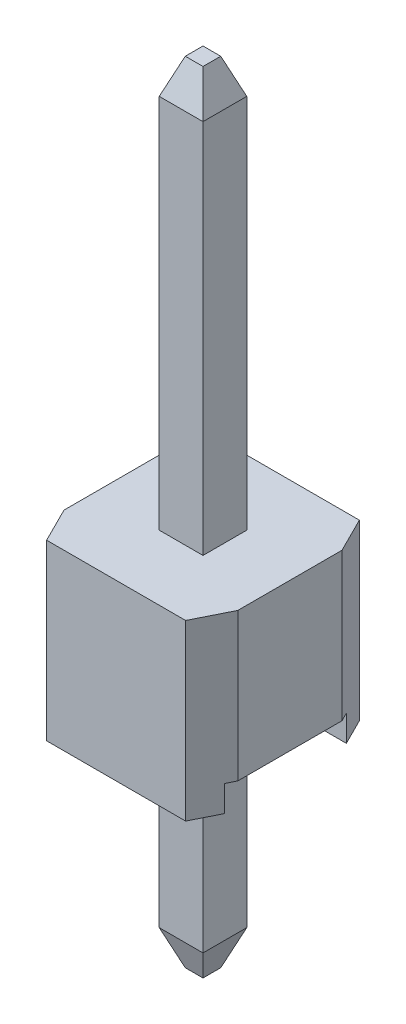
ISO-10303-21;
HEADER;
FILE_DESCRIPTION(('STEP AP214'),'2;1');
FILE_NAME('part.step','',(''),(''),'','','');
FILE_SCHEMA(('AUTOMOTIVE_DESIGN { 1 0 10303 214 1 1 1 1 }'));
ENDSEC;
DATA;
#1=APPLICATION_CONTEXT('core data for automotive mechanical design processes');
#2=APPLICATION_PROTOCOL_DEFINITION('international standard','automotive_design',2000,#1);
#3=PRODUCT_CONTEXT('',#1,'mechanical');
#4=PRODUCT('Part','Part','',(#3));
#5=PRODUCT_RELATED_PRODUCT_CATEGORY('part','',(#4));
#6=PRODUCT_DEFINITION_FORMATION('','',#4);
#7=PRODUCT_DEFINITION_CONTEXT('part definition',#1,'design');
#8=PRODUCT_DEFINITION('design','',#6,#7);
#9=PRODUCT_DEFINITION_SHAPE('','',#8);
#10=(LENGTH_UNIT() NAMED_UNIT(*) SI_UNIT(.MILLI.,.METRE.));
#11=(NAMED_UNIT(*) PLANE_ANGLE_UNIT() SI_UNIT($,.RADIAN.));
#12=(NAMED_UNIT(*) SI_UNIT($,.STERADIAN.) SOLID_ANGLE_UNIT());
#13=UNCERTAINTY_MEASURE_WITH_UNIT(LENGTH_MEASURE(1.E-05),#10,'distance_accuracy_value','');
#14=(GEOMETRIC_REPRESENTATION_CONTEXT(3) GLOBAL_UNCERTAINTY_ASSIGNED_CONTEXT((#13)) GLOBAL_UNIT_ASSIGNED_CONTEXT((#10,
#11,#12)) REPRESENTATION_CONTEXT('',''));
#15=CARTESIAN_POINT('',(0.,0.,0.));
#16=DIRECTION('',(0.,0.,1.));
#17=DIRECTION('',(1.,0.,0.));
#18=AXIS2_PLACEMENT_3D('',#15,#16,#17);
#19=CARTESIAN_POINT('',(0.,2.54,0.));
#20=DIRECTION('',(0.,0.,-1.));
#21=DIRECTION('',(-1.,0.,0.));
#22=AXIS2_PLACEMENT_3D('',#19,#20,#21);
#23=PLANE('',#22);
#24=DIRECTION('',(0.,1.,0.));
#25=VECTOR('',#24,1.);
#26=CARTESIAN_POINT('',(2.286,0.,0.));
#27=LINE('',#26,#25);
#28=CARTESIAN_POINT('',(2.286,0.,0.));
#29=VERTEX_POINT('',#28);
#30=CARTESIAN_POINT('',(2.286,2.54,0.));
#31=VERTEX_POINT('',#30);
#32=EDGE_CURVE('E388',#29,#31,#27,.T.);
#33=ORIENTED_EDGE('',*,*,#32,.T.);
#34=DIRECTION('',(1.,0.,0.));
#35=VECTOR('',#34,1.);
#36=CARTESIAN_POINT('',(0.,2.54,0.));
#37=LINE('',#36,#35);
#38=CARTESIAN_POINT('',(0.254,2.54,0.));
#39=VERTEX_POINT('',#38);
#40=EDGE_CURVE('E456',#39,#31,#37,.T.);
#41=ORIENTED_EDGE('',*,*,#40,.F.);
#42=DIRECTION('',(0.,1.,0.));
#43=VECTOR('',#42,1.);
#44=CARTESIAN_POINT('',(0.254,0.,0.));
#45=LINE('',#44,#43);
#46=CARTESIAN_POINT('',(0.254,0.,0.));
#47=VERTEX_POINT('',#46);
#48=EDGE_CURVE('E399',#47,#39,#45,.T.);
#49=ORIENTED_EDGE('',*,*,#48,.F.);
#50=DIRECTION('',(1.,0.,0.));
#51=VECTOR('',#50,1.);
#52=CARTESIAN_POINT('',(0.,0.,0.));
#53=LINE('',#52,#51);
#54=EDGE_CURVE('E447',#47,#29,#53,.T.);
#55=ORIENTED_EDGE('',*,*,#54,.T.);
#56=EDGE_LOOP('',(#33,#41,#49,#55));
#57=FACE_BOUND('',#56,.T.);
#58=ADVANCED_FACE('F35',(#57),#23,.F.);
#59=CARTESIAN_POINT('',(0.,2.54,0.));
#60=DIRECTION('',(0.,-1.,0.));
#61=DIRECTION('',(0.,0.,-1.));
#62=AXIS2_PLACEMENT_3D('',#59,#60,#61);
#63=PLANE('',#62);
#64=DIRECTION('',(0.,0.,1.));
#65=VECTOR('',#64,1.);
#66=CARTESIAN_POINT('',(1.59,2.54,0.));
#67=LINE('',#66,#65);
#68=CARTESIAN_POINT('',(1.59,2.54,-1.59));
#69=VERTEX_POINT('',#68);
#70=CARTESIAN_POINT('',(1.59,2.54,-0.95));
#71=VERTEX_POINT('',#70);
#72=EDGE_CURVE('E376',#69,#71,#67,.T.);
#73=ORIENTED_EDGE('',*,*,#72,.T.);
#74=DIRECTION('',(-1.,0.,0.));
#75=VECTOR('',#74,1.);
#76=CARTESIAN_POINT('',(0.,2.54,-0.95));
#77=LINE('',#76,#75);
#78=CARTESIAN_POINT('',(0.95,2.54,-0.95));
#79=VERTEX_POINT('',#78);
#80=EDGE_CURVE('E386',#71,#79,#77,.T.);
#81=ORIENTED_EDGE('',*,*,#80,.T.);
#82=DIRECTION('',(0.,0.,-1.));
#83=VECTOR('',#82,1.);
#84=CARTESIAN_POINT('',(0.95,2.54,0.));
#85=LINE('',#84,#83);
#86=CARTESIAN_POINT('',(0.95,2.54,-1.59));
#87=VERTEX_POINT('',#86);
#88=EDGE_CURVE('E360',#79,#87,#85,.T.);
#89=ORIENTED_EDGE('',*,*,#88,.T.);
#90=DIRECTION('',(1.,0.,0.));
#91=VECTOR('',#90,1.);
#92=CARTESIAN_POINT('',(0.,2.54,-1.59));
#93=LINE('',#92,#91);
#94=EDGE_CURVE('E383',#87,#69,#93,.T.);
#95=ORIENTED_EDGE('',*,*,#94,.T.);
#96=EDGE_LOOP('',(#73,#81,#89,#95));
#97=FACE_BOUND('',#96,.T.);
#98=DIRECTION('',(0.447213595499958,0.,-0.894427190999916));
#99=VECTOR('',#98,1.);
#100=CARTESIAN_POINT('',(2.286,2.54,0.));
#101=LINE('',#100,#99);
#102=CARTESIAN_POINT('',(2.54,2.54,-0.508));
#103=VERTEX_POINT('',#102);
#104=EDGE_CURVE('E391',#31,#103,#101,.T.);
#105=ORIENTED_EDGE('',*,*,#104,.T.);
#106=DIRECTION('',(0.,0.,-1.));
#107=VECTOR('',#106,1.);
#108=CARTESIAN_POINT('',(2.54,2.54,0.));
#109=LINE('',#108,#107);
#110=CARTESIAN_POINT('',(2.54,2.54,-2.032));
#111=VERTEX_POINT('',#110);
#112=EDGE_CURVE('E460',#103,#111,#109,.T.);
#113=ORIENTED_EDGE('',*,*,#112,.T.);
#114=DIRECTION('',(0.447213595499958,0.,0.894427190999916));
#115=VECTOR('',#114,1.);
#116=CARTESIAN_POINT('',(2.8448,2.54,-1.4224));
#117=LINE('',#116,#115);
#118=CARTESIAN_POINT('',(2.286,2.54,-2.54));
#119=VERTEX_POINT('',#118);
#120=EDGE_CURVE('E418',#119,#111,#117,.T.);
#121=ORIENTED_EDGE('',*,*,#120,.F.);
#122=DIRECTION('',(-1.,0.,0.));
#123=VECTOR('',#122,1.);
#124=CARTESIAN_POINT('',(0.,2.54,-2.54));
#125=LINE('',#124,#123);
#126=CARTESIAN_POINT('',(0.254,2.54,-2.54));
#127=VERTEX_POINT('',#126);
#128=EDGE_CURVE('E462',#119,#127,#125,.T.);
#129=ORIENTED_EDGE('',*,*,#128,.T.);
#130=DIRECTION('',(0.447213595499958,0.,-0.894427190999916));
#131=VECTOR('',#130,1.);
#132=CARTESIAN_POINT('',(-0.812799999999999,2.54,-0.406399999999999));
#133=LINE('',#132,#131);
#134=CARTESIAN_POINT('',(0.,2.54,-2.032));
#135=VERTEX_POINT('',#134);
#136=EDGE_CURVE('E426',#135,#127,#133,.T.);
#137=ORIENTED_EDGE('',*,*,#136,.F.);
#138=DIRECTION('',(0.,0.,1.));
#139=VECTOR('',#138,1.);
#140=CARTESIAN_POINT('',(0.,2.54,0.));
#141=LINE('',#140,#139);
#142=CARTESIAN_POINT('',(0.,2.54,-0.508));
#143=VERTEX_POINT('',#142);
#144=EDGE_CURVE('E453',#135,#143,#141,.T.);
#145=ORIENTED_EDGE('',*,*,#144,.T.);
#146=DIRECTION('',(0.447213595499958,0.,0.894427190999916));
#147=VECTOR('',#146,1.);
#148=CARTESIAN_POINT('',(0.2032,2.54,-0.1016));
#149=LINE('',#148,#147);
#150=EDGE_CURVE('E405',#143,#39,#149,.T.);
#151=ORIENTED_EDGE('',*,*,#150,.T.);
#152=ORIENTED_EDGE('',*,*,#40,.T.);
#153=EDGE_LOOP('',(#105,#113,#121,#129,#137,#145,#151,#152));
#154=FACE_BOUND('',#153,.T.);
#155=ADVANCED_FACE('F301',(#97,#154),#63,.F.);
#156=CARTESIAN_POINT('',(0.,0.,0.));
#157=DIRECTION('',(0.,-1.,0.));
#158=DIRECTION('',(0.,0.,-1.));
#159=AXIS2_PLACEMENT_3D('',#156,#157,#158);
#160=PLANE('',#159);
#161=DIRECTION('',(-1.,0.,0.));
#162=VECTOR('',#161,1.);
#163=CARTESIAN_POINT('',(2.54,0.,-0.381));
#164=LINE('',#163,#162);
#165=CARTESIAN_POINT('',(2.4765,0.,-0.381));
#166=VERTEX_POINT('',#165);
#167=CARTESIAN_POINT('',(0.0635000000000002,0.,-0.381));
#168=VERTEX_POINT('',#167);
#169=EDGE_CURVE('E450',#166,#168,#164,.T.);
#170=ORIENTED_EDGE('',*,*,#169,.F.);
#171=DIRECTION('',(0.447213595499958,0.,-0.894427190999916));
#172=VECTOR('',#171,1.);
#173=CARTESIAN_POINT('',(2.286,0.,0.));
#174=LINE('',#173,#172);
#175=EDGE_CURVE('E390',#29,#166,#174,.T.);
#176=ORIENTED_EDGE('',*,*,#175,.F.);
#177=ORIENTED_EDGE('',*,*,#54,.F.);
#178=DIRECTION('',(0.447213595499958,0.,0.894427190999916));
#179=VECTOR('',#178,1.);
#180=CARTESIAN_POINT('',(0.2032,0.,-0.1016));
#181=LINE('',#180,#179);
#182=EDGE_CURVE('E403',#168,#47,#181,.T.);
#183=ORIENTED_EDGE('',*,*,#182,.F.);
#184=EDGE_LOOP('',(#170,#176,#177,#183));
#185=FACE_BOUND('',#184,.T.);
#186=ADVANCED_FACE('F307',(#185),#160,.T.);
#187=CARTESIAN_POINT('',(2.54,0.381,-2.159));
#188=DIRECTION('',(0.,1.,0.));
#189=DIRECTION('',(0.,0.,1.));
#190=AXIS2_PLACEMENT_3D('',#187,#188,#189);
#191=PLANE('',#190);
#192=DIRECTION('',(0.,0.,1.));
#193=VECTOR('',#192,1.);
#194=CARTESIAN_POINT('',(0.95,0.381,-2.159));
#195=LINE('',#194,#193);
#196=CARTESIAN_POINT('',(0.95,0.381,-1.59));
#197=VERTEX_POINT('',#196);
#198=CARTESIAN_POINT('',(0.95,0.381,-0.95));
#199=VERTEX_POINT('',#198);
#200=EDGE_CURVE('E209',#197,#199,#195,.T.);
#201=ORIENTED_EDGE('',*,*,#200,.T.);
#202=DIRECTION('',(1.,0.,0.));
#203=VECTOR('',#202,1.);
#204=CARTESIAN_POINT('',(2.54,0.381,-0.95));
#205=LINE('',#204,#203);
#206=CARTESIAN_POINT('',(1.59,0.381,-0.95));
#207=VERTEX_POINT('',#206);
#208=EDGE_CURVE('E222',#199,#207,#205,.T.);
#209=ORIENTED_EDGE('',*,*,#208,.T.);
#210=DIRECTION('',(0.,0.,-1.));
#211=VECTOR('',#210,1.);
#212=CARTESIAN_POINT('',(1.59,0.381,-2.159));
#213=LINE('',#212,#211);
#214=CARTESIAN_POINT('',(1.59,0.381,-1.59));
#215=VERTEX_POINT('',#214);
#216=EDGE_CURVE('E220',#207,#215,#213,.T.);
#217=ORIENTED_EDGE('',*,*,#216,.T.);
#218=DIRECTION('',(-1.,0.,0.));
#219=VECTOR('',#218,1.);
#220=CARTESIAN_POINT('',(2.54,0.381,-1.59));
#221=LINE('',#220,#219);
#222=EDGE_CURVE('E201',#215,#197,#221,.T.);
#223=ORIENTED_EDGE('',*,*,#222,.T.);
#224=EDGE_LOOP('',(#201,#209,#217,#223));
#225=FACE_BOUND('',#224,.T.);
#226=DIRECTION('',(0.447213595499958,0.,-0.894427190999916));
#227=VECTOR('',#226,1.);
#228=CARTESIAN_POINT('',(3.2004,0.381,-1.8288));
#229=LINE('',#228,#227);
#230=CARTESIAN_POINT('',(2.4765,0.381,-0.381));
#231=VERTEX_POINT('',#230);
#232=CARTESIAN_POINT('',(2.54,0.381,-0.508));
#233=VERTEX_POINT('',#232);
#234=EDGE_CURVE('E397',#231,#233,#229,.T.);
#235=ORIENTED_EDGE('',*,*,#234,.F.);
#236=DIRECTION('',(-1.,0.,0.));
#237=VECTOR('',#236,1.);
#238=CARTESIAN_POINT('',(2.54,0.381,-0.381));
#239=LINE('',#238,#237);
#240=CARTESIAN_POINT('',(0.0635000000000002,0.381,-0.381));
#241=VERTEX_POINT('',#240);
#242=EDGE_CURVE('E448',#231,#241,#239,.T.);
#243=ORIENTED_EDGE('',*,*,#242,.T.);
#244=DIRECTION('',(0.447213595499958,0.,0.894427190999916));
#245=VECTOR('',#244,1.);
#246=CARTESIAN_POINT('',(-0.1524,0.381,-0.812800000000001));
#247=LINE('',#246,#245);
#248=CARTESIAN_POINT('',(0.,0.381,-0.508));
#249=VERTEX_POINT('',#248);
#250=EDGE_CURVE('E408',#249,#241,#247,.T.);
#251=ORIENTED_EDGE('',*,*,#250,.F.);
#252=DIRECTION('',(0.,0.,-1.));
#253=VECTOR('',#252,1.);
#254=CARTESIAN_POINT('',(0.,0.381,-2.159));
#255=LINE('',#254,#253);
#256=CARTESIAN_POINT('',(0.,0.381,-2.032));
#257=VERTEX_POINT('',#256);
#258=EDGE_CURVE('E440',#249,#257,#255,.T.);
#259=ORIENTED_EDGE('',*,*,#258,.T.);
#260=DIRECTION('',(0.447213595499958,0.,-0.894427190999916));
#261=VECTOR('',#260,1.);
#262=CARTESIAN_POINT('',(0.5588,0.381,-3.1496));
#263=LINE('',#262,#261);
#264=CARTESIAN_POINT('',(0.0635000000000005,0.381,-2.159));
#265=VERTEX_POINT('',#264);
#266=EDGE_CURVE('E464',#257,#265,#263,.T.);
#267=ORIENTED_EDGE('',*,*,#266,.T.);
#268=DIRECTION('',(-1.,0.,0.));
#269=VECTOR('',#268,1.);
#270=CARTESIAN_POINT('',(2.54,0.381,-2.159));
#271=LINE('',#270,#269);
#272=CARTESIAN_POINT('',(2.4765,0.381,-2.159));
#273=VERTEX_POINT('',#272);
#274=EDGE_CURVE('E445',#273,#265,#271,.T.);
#275=ORIENTED_EDGE('',*,*,#274,.F.);
#276=DIRECTION('',(0.447213595499958,0.,0.894427190999916));
#277=VECTOR('',#276,1.);
#278=CARTESIAN_POINT('',(2.4892,0.381,-2.1336));
#279=LINE('',#278,#277);
#280=CARTESIAN_POINT('',(2.54,0.381,-2.032));
#281=VERTEX_POINT('',#280);
#282=EDGE_CURVE('E470',#273,#281,#279,.T.);
#283=ORIENTED_EDGE('',*,*,#282,.T.);
#284=DIRECTION('',(0.,0.,-1.));
#285=VECTOR('',#284,1.);
#286=CARTESIAN_POINT('',(2.54,0.381,-2.159));
#287=LINE('',#286,#285);
#288=EDGE_CURVE('E441',#233,#281,#287,.T.);
#289=ORIENTED_EDGE('',*,*,#288,.F.);
#290=EDGE_LOOP('',(#235,#243,#251,#259,#267,#275,#283,#289));
#291=FACE_BOUND('',#290,.T.);
#292=ADVANCED_FACE('F217',(#225,#291),#191,.F.);
#293=CARTESIAN_POINT('',(2.54,0.,-0.381));
#294=DIRECTION('',(0.,0.,1.));
#295=DIRECTION('',(1.,0.,0.));
#296=AXIS2_PLACEMENT_3D('',#293,#294,#295);
#297=PLANE('',#296);
#298=DIRECTION('',(0.,1.,0.));
#299=VECTOR('',#298,1.);
#300=CARTESIAN_POINT('',(2.4765,0.,-0.381));
#301=LINE('',#300,#299);
#302=EDGE_CURVE('E394',#166,#231,#301,.T.);
#303=ORIENTED_EDGE('',*,*,#302,.F.);
#304=ORIENTED_EDGE('',*,*,#169,.T.);
#305=DIRECTION('',(0.,-1.,0.));
#306=VECTOR('',#305,1.);
#307=CARTESIAN_POINT('',(0.0635000000000002,0.,-0.381));
#308=LINE('',#307,#306);
#309=EDGE_CURVE('E473',#241,#168,#308,.T.);
#310=ORIENTED_EDGE('',*,*,#309,.F.);
#311=ORIENTED_EDGE('',*,*,#242,.F.);
#312=EDGE_LOOP('',(#303,#304,#310,#311));
#313=FACE_BOUND('',#312,.T.);
#314=ADVANCED_FACE('F518',(#313),#297,.F.);
#315=CARTESIAN_POINT('',(2.54,2.54,0.));
#316=DIRECTION('',(-1.,0.,0.));
#317=DIRECTION('',(0.,0.,1.));
#318=AXIS2_PLACEMENT_3D('',#315,#316,#317);
#319=PLANE('',#318);
#320=DIRECTION('',(0.,1.,0.));
#321=VECTOR('',#320,1.);
#322=CARTESIAN_POINT('',(2.54,2.54,-0.508));
#323=LINE('',#322,#321);
#324=EDGE_CURVE('E215',#233,#103,#323,.T.);
#325=ORIENTED_EDGE('',*,*,#324,.F.);
#326=ORIENTED_EDGE('',*,*,#288,.T.);
#327=DIRECTION('',(0.,1.,0.));
#328=VECTOR('',#327,1.);
#329=CARTESIAN_POINT('',(2.54,0.,-2.032));
#330=LINE('',#329,#328);
#331=EDGE_CURVE('E412',#281,#111,#330,.T.);
#332=ORIENTED_EDGE('',*,*,#331,.T.);
#333=ORIENTED_EDGE('',*,*,#112,.F.);
#334=EDGE_LOOP('',(#325,#326,#332,#333));
#335=FACE_BOUND('',#334,.T.);
#336=ADVANCED_FACE('F313',(#335),#319,.F.);
#337=CARTESIAN_POINT('',(0.,2.54,0.));
#338=DIRECTION('',(1.,0.,0.));
#339=DIRECTION('',(0.,0.,-1.));
#340=AXIS2_PLACEMENT_3D('',#337,#338,#339);
#341=PLANE('',#340);
#342=DIRECTION('',(0.,1.,0.));
#343=VECTOR('',#342,1.);
#344=CARTESIAN_POINT('',(0.,0.,-0.508));
#345=LINE('',#344,#343);
#346=EDGE_CURVE('E400',#249,#143,#345,.T.);
#347=ORIENTED_EDGE('',*,*,#346,.T.);
#348=ORIENTED_EDGE('',*,*,#144,.F.);
#349=DIRECTION('',(0.,1.,0.));
#350=VECTOR('',#349,1.);
#351=CARTESIAN_POINT('',(0.,0.,-2.032));
#352=LINE('',#351,#350);
#353=EDGE_CURVE('E430',#257,#135,#352,.T.);
#354=ORIENTED_EDGE('',*,*,#353,.F.);
#355=ORIENTED_EDGE('',*,*,#258,.F.);
#356=EDGE_LOOP('',(#347,#348,#354,#355));
#357=FACE_BOUND('',#356,.T.);
#358=ADVANCED_FACE('F315',(#357),#341,.F.);
#359=DIRECTION('',(0.447213595499958,0.,0.894427190999916));
#360=VECTOR('',#359,1.);
#361=CARTESIAN_POINT('',(2.8448,0.,-1.4224));
#362=LINE('',#361,#360);
#363=CARTESIAN_POINT('',(2.286,0.,-2.54));
#364=VERTEX_POINT('',#363);
#365=CARTESIAN_POINT('',(2.4765,0.,-2.159));
#366=VERTEX_POINT('',#365);
#367=EDGE_CURVE('E415',#364,#366,#362,.T.);
#368=ORIENTED_EDGE('',*,*,#367,.T.);
#369=DIRECTION('',(-1.,0.,0.));
#370=VECTOR('',#369,1.);
#371=CARTESIAN_POINT('',(2.54,0.,-2.159));
#372=LINE('',#371,#370);
#373=CARTESIAN_POINT('',(0.0635000000000002,0.,-2.159));
#374=VERTEX_POINT('',#373);
#375=EDGE_CURVE('E443',#366,#374,#372,.T.);
#376=ORIENTED_EDGE('',*,*,#375,.T.);
#377=DIRECTION('',(0.447213595499958,0.,-0.894427190999916));
#378=VECTOR('',#377,1.);
#379=CARTESIAN_POINT('',(-0.812799999999999,0.,-0.406399999999999));
#380=LINE('',#379,#378);
#381=CARTESIAN_POINT('',(0.254,0.,-2.54));
#382=VERTEX_POINT('',#381);
#383=EDGE_CURVE('E427',#374,#382,#380,.T.);
#384=ORIENTED_EDGE('',*,*,#383,.T.);
#385=DIRECTION('',(-1.,0.,0.));
#386=VECTOR('',#385,1.);
#387=CARTESIAN_POINT('',(0.,0.,-2.54));
#388=LINE('',#387,#386);
#389=EDGE_CURVE('E457',#364,#382,#388,.T.);
#390=ORIENTED_EDGE('',*,*,#389,.F.);
#391=EDGE_LOOP('',(#368,#376,#384,#390));
#392=FACE_BOUND('',#391,.T.);
#393=ADVANCED_FACE('F318',(#392),#160,.T.);
#394=CARTESIAN_POINT('',(0.,2.54,-2.54));
#395=DIRECTION('',(0.,0.,1.));
#396=DIRECTION('',(1.,0.,0.));
#397=AXIS2_PLACEMENT_3D('',#394,#395,#396);
#398=PLANE('',#397);
#399=ORIENTED_EDGE('',*,*,#128,.F.);
#400=DIRECTION('',(0.,1.,0.));
#401=VECTOR('',#400,1.);
#402=CARTESIAN_POINT('',(2.286,0.,-2.54));
#403=LINE('',#402,#401);
#404=EDGE_CURVE('E413',#364,#119,#403,.T.);
#405=ORIENTED_EDGE('',*,*,#404,.F.);
#406=ORIENTED_EDGE('',*,*,#389,.T.);
#407=DIRECTION('',(0.,1.,0.));
#408=VECTOR('',#407,1.);
#409=CARTESIAN_POINT('',(0.254,0.,-2.54));
#410=LINE('',#409,#408);
#411=EDGE_CURVE('E433',#382,#127,#410,.T.);
#412=ORIENTED_EDGE('',*,*,#411,.T.);
#413=EDGE_LOOP('',(#399,#405,#406,#412));
#414=FACE_BOUND('',#413,.T.);
#415=ADVANCED_FACE('F504',(#414),#398,.F.);
#416=CARTESIAN_POINT('',(2.54,0.,-2.159));
#417=DIRECTION('',(0.,0.,-1.));
#418=DIRECTION('',(-1.,0.,0.));
#419=AXIS2_PLACEMENT_3D('',#416,#417,#418);
#420=PLANE('',#419);
#421=ORIENTED_EDGE('',*,*,#375,.F.);
#422=DIRECTION('',(0.,1.,0.));
#423=VECTOR('',#422,1.);
#424=CARTESIAN_POINT('',(2.4765,0.,-2.159));
#425=LINE('',#424,#423);
#426=EDGE_CURVE('E421',#366,#273,#425,.T.);
#427=ORIENTED_EDGE('',*,*,#426,.T.);
#428=ORIENTED_EDGE('',*,*,#274,.T.);
#429=DIRECTION('',(0.,-1.,0.));
#430=VECTOR('',#429,1.);
#431=CARTESIAN_POINT('',(0.0635000000000002,0.,-2.159));
#432=LINE('',#431,#430);
#433=EDGE_CURVE('E436',#265,#374,#432,.T.);
#434=ORIENTED_EDGE('',*,*,#433,.T.);
#435=EDGE_LOOP('',(#421,#427,#428,#434));
#436=FACE_BOUND('',#435,.T.);
#437=ADVANCED_FACE('F493',(#436),#420,.F.);
#438=CARTESIAN_POINT('',(-0.812799999999999,0.,-0.406399999999999));
#439=DIRECTION('',(0.894427190999916,0.,0.447213595499958));
#440=DIRECTION('',(0.447213595499958,0.,-0.894427190999916));
#441=AXIS2_PLACEMENT_3D('',#438,#439,#440);
#442=PLANE('',#441);
#443=ORIENTED_EDGE('',*,*,#266,.F.);
#444=ORIENTED_EDGE('',*,*,#353,.T.);
#445=ORIENTED_EDGE('',*,*,#136,.T.);
#446=ORIENTED_EDGE('',*,*,#411,.F.);
#447=ORIENTED_EDGE('',*,*,#383,.F.);
#448=ORIENTED_EDGE('',*,*,#433,.F.);
#449=EDGE_LOOP('',(#443,#444,#445,#446,#447,#448));
#450=FACE_BOUND('',#449,.T.);
#451=ADVANCED_FACE('F496',(#450),#442,.F.);
#452=CARTESIAN_POINT('',(2.8448,0.,-1.4224));
#453=DIRECTION('',(-0.894427190999916,0.,0.447213595499958));
#454=DIRECTION('',(0.447213595499958,0.,0.894427190999916));
#455=AXIS2_PLACEMENT_3D('',#452,#453,#454);
#456=PLANE('',#455);
#457=ORIENTED_EDGE('',*,*,#367,.F.);
#458=ORIENTED_EDGE('',*,*,#404,.T.);
#459=ORIENTED_EDGE('',*,*,#120,.T.);
#460=ORIENTED_EDGE('',*,*,#331,.F.);
#461=ORIENTED_EDGE('',*,*,#282,.F.);
#462=ORIENTED_EDGE('',*,*,#426,.F.);
#463=EDGE_LOOP('',(#457,#458,#459,#460,#461,#462));
#464=FACE_BOUND('',#463,.T.);
#465=ADVANCED_FACE('F487',(#464),#456,.F.);
#466=CARTESIAN_POINT('',(0.2032,0.,-0.1016));
#467=DIRECTION('',(-0.894427190999916,0.,0.447213595499958));
#468=DIRECTION('',(0.447213595499958,0.,0.894427190999916));
#469=AXIS2_PLACEMENT_3D('',#466,#467,#468);
#470=PLANE('',#469);
#471=ORIENTED_EDGE('',*,*,#250,.T.);
#472=ORIENTED_EDGE('',*,*,#309,.T.);
#473=ORIENTED_EDGE('',*,*,#182,.T.);
#474=ORIENTED_EDGE('',*,*,#48,.T.);
#475=ORIENTED_EDGE('',*,*,#150,.F.);
#476=ORIENTED_EDGE('',*,*,#346,.F.);
#477=EDGE_LOOP('',(#471,#472,#473,#474,#475,#476));
#478=FACE_BOUND('',#477,.T.);
#479=ADVANCED_FACE('F520',(#478),#470,.T.);
#480=CARTESIAN_POINT('',(2.286,0.,0.));
#481=DIRECTION('',(0.894427190999916,0.,0.447213595499958));
#482=DIRECTION('',(0.447213595499958,0.,-0.894427190999916));
#483=AXIS2_PLACEMENT_3D('',#480,#481,#482);
#484=PLANE('',#483);
#485=ORIENTED_EDGE('',*,*,#234,.T.);
#486=ORIENTED_EDGE('',*,*,#324,.T.);
#487=ORIENTED_EDGE('',*,*,#104,.F.);
#488=ORIENTED_EDGE('',*,*,#32,.F.);
#489=ORIENTED_EDGE('',*,*,#175,.T.);
#490=ORIENTED_EDGE('',*,*,#302,.T.);
#491=EDGE_LOOP('',(#485,#486,#487,#488,#489,#490));
#492=FACE_BOUND('',#491,.T.);
#493=ADVANCED_FACE('F477',(#492),#484,.T.);
#494=CARTESIAN_POINT('',(0.,-3.,0.));
#495=DIRECTION('',(0.,-1.,0.));
#496=DIRECTION('',(0.,0.,-1.));
#497=AXIS2_PLACEMENT_3D('',#494,#495,#496);
#498=PLANE('',#497);
#499=DIRECTION('',(0.,0.,-1.));
#500=VECTOR('',#499,1.);
#501=CARTESIAN_POINT('',(1.1405,-3.,0.));
#502=LINE('',#501,#500);
#503=CARTESIAN_POINT('',(1.1405,-3.,-1.1405));
#504=VERTEX_POINT('',#503);
#505=CARTESIAN_POINT('',(1.1405,-3.,-1.3995));
#506=VERTEX_POINT('',#505);
#507=EDGE_CURVE('E257',#504,#506,#502,.T.);
#508=ORIENTED_EDGE('',*,*,#507,.T.);
#509=DIRECTION('',(1.,0.,0.));
#510=VECTOR('',#509,1.);
#511=CARTESIAN_POINT('',(0.,-3.,-1.3995));
#512=LINE('',#511,#510);
#513=CARTESIAN_POINT('',(1.3995,-3.,-1.3995));
#514=VERTEX_POINT('',#513);
#515=EDGE_CURVE('E263',#506,#514,#512,.T.);
#516=ORIENTED_EDGE('',*,*,#515,.T.);
#517=DIRECTION('',(0.,0.,1.));
#518=VECTOR('',#517,1.);
#519=CARTESIAN_POINT('',(1.3995,-3.,0.));
#520=LINE('',#519,#518);
#521=CARTESIAN_POINT('',(1.3995,-3.,-1.1405));
#522=VERTEX_POINT('',#521);
#523=EDGE_CURVE('E261',#514,#522,#520,.T.);
#524=ORIENTED_EDGE('',*,*,#523,.T.);
#525=DIRECTION('',(-1.,0.,0.));
#526=VECTOR('',#525,1.);
#527=CARTESIAN_POINT('',(0.,-3.,-1.1405));
#528=LINE('',#527,#526);
#529=EDGE_CURVE('E259',#522,#504,#528,.T.);
#530=ORIENTED_EDGE('',*,*,#529,.T.);
#531=EDGE_LOOP('',(#508,#516,#524,#530));
#532=FACE_BOUND('',#531,.T.);
#533=ADVANCED_FACE('F287',(#532),#498,.T.);
#534=CARTESIAN_POINT('',(0.95,-6.90509667991878,-0.95));
#535=DIRECTION('',(-1.,0.,0.));
#536=DIRECTION('',(0.,0.,1.));
#537=AXIS2_PLACEMENT_3D('',#534,#535,#536);
#538=PLANE('',#537);
#539=DIRECTION('',(0.,1.,0.));
#540=VECTOR('',#539,1.);
#541=CARTESIAN_POINT('',(0.95,-6.90509667991878,-1.59));
#542=LINE('',#541,#540);
#543=CARTESIAN_POINT('',(0.95,-2.492,-1.59));
#544=VERTEX_POINT('',#543);
#545=EDGE_CURVE('E196',#544,#197,#542,.T.);
#546=ORIENTED_EDGE('',*,*,#545,.F.);
#547=DIRECTION('',(0.,0.,1.));
#548=VECTOR('',#547,1.);
#549=CARTESIAN_POINT('',(0.95,-2.492,-0.95));
#550=LINE('',#549,#548);
#551=CARTESIAN_POINT('',(0.95,-2.492,-0.95));
#552=VERTEX_POINT('',#551);
#553=EDGE_CURVE('E12',#544,#552,#550,.T.);
#554=ORIENTED_EDGE('',*,*,#553,.T.);
#555=DIRECTION('',(0.,1.,0.));
#556=VECTOR('',#555,1.);
#557=CARTESIAN_POINT('',(0.95,-6.90509667991878,-0.95));
#558=LINE('',#557,#556);
#559=EDGE_CURVE('E211',#552,#199,#558,.T.);
#560=ORIENTED_EDGE('',*,*,#559,.T.);
#561=ORIENTED_EDGE('',*,*,#200,.F.);
#562=EDGE_LOOP('',(#546,#554,#560,#561));
#563=FACE_BOUND('',#562,.T.);
#564=ADVANCED_FACE('F210',(#563),#538,.T.);
#565=CARTESIAN_POINT('',(0.95,-6.90509667991878,-1.59));
#566=DIRECTION('',(0.,0.,-1.));
#567=DIRECTION('',(-1.,0.,0.));
#568=AXIS2_PLACEMENT_3D('',#565,#566,#567);
#569=PLANE('',#568);
#570=DIRECTION('',(0.,1.,0.));
#571=VECTOR('',#570,1.);
#572=CARTESIAN_POINT('',(1.59,-6.90509667991878,-1.59));
#573=LINE('',#572,#571);
#574=CARTESIAN_POINT('',(1.59,-2.492,-1.59));
#575=VERTEX_POINT('',#574);
#576=EDGE_CURVE('E377',#575,#215,#573,.T.);
#577=ORIENTED_EDGE('',*,*,#576,.F.);
#578=DIRECTION('',(-1.,0.,0.));
#579=VECTOR('',#578,1.);
#580=CARTESIAN_POINT('',(0.95,-2.492,-1.59));
#581=LINE('',#580,#579);
#582=EDGE_CURVE('E204',#575,#544,#581,.T.);
#583=ORIENTED_EDGE('',*,*,#582,.T.);
#584=ORIENTED_EDGE('',*,*,#545,.T.);
#585=ORIENTED_EDGE('',*,*,#222,.F.);
#586=EDGE_LOOP('',(#577,#583,#584,#585));
#587=FACE_BOUND('',#586,.T.);
#588=ADVANCED_FACE('F199',(#587),#569,.T.);
#589=CARTESIAN_POINT('',(1.59,-6.90509667991878,-0.95));
#590=DIRECTION('',(1.,0.,0.));
#591=DIRECTION('',(0.,0.,-1.));
#592=AXIS2_PLACEMENT_3D('',#589,#590,#591);
#593=PLANE('',#592);
#594=DIRECTION('',(0.,1.,0.));
#595=VECTOR('',#594,1.);
#596=CARTESIAN_POINT('',(1.59,-6.90509667991878,-0.95));
#597=LINE('',#596,#595);
#598=CARTESIAN_POINT('',(1.59,-2.492,-0.95));
#599=VERTEX_POINT('',#598);
#600=EDGE_CURVE('E378',#599,#207,#597,.T.);
#601=ORIENTED_EDGE('',*,*,#600,.F.);
#602=DIRECTION('',(0.,0.,-1.));
#603=VECTOR('',#602,1.);
#604=CARTESIAN_POINT('',(1.59,-2.492,-0.95));
#605=LINE('',#604,#603);
#606=EDGE_CURVE('E266',#599,#575,#605,.T.);
#607=ORIENTED_EDGE('',*,*,#606,.T.);
#608=ORIENTED_EDGE('',*,*,#576,.T.);
#609=ORIENTED_EDGE('',*,*,#216,.F.);
#610=EDGE_LOOP('',(#601,#607,#608,#609));
#611=FACE_BOUND('',#610,.T.);
#612=ADVANCED_FACE('F641',(#611),#593,.T.);
#613=CARTESIAN_POINT('',(0.95,-6.90509667991878,-0.95));
#614=DIRECTION('',(0.,0.,1.));
#615=DIRECTION('',(1.,0.,0.));
#616=AXIS2_PLACEMENT_3D('',#613,#614,#615);
#617=PLANE('',#616);
#618=ORIENTED_EDGE('',*,*,#559,.F.);
#619=DIRECTION('',(1.,0.,0.));
#620=VECTOR('',#619,1.);
#621=CARTESIAN_POINT('',(0.95,-2.492,-0.95));
#622=LINE('',#621,#620);
#623=EDGE_CURVE('E44',#552,#599,#622,.T.);
#624=ORIENTED_EDGE('',*,*,#623,.T.);
#625=ORIENTED_EDGE('',*,*,#600,.T.);
#626=ORIENTED_EDGE('',*,*,#208,.F.);
#627=EDGE_LOOP('',(#618,#624,#625,#626));
#628=FACE_BOUND('',#627,.T.);
#629=ADVANCED_FACE('F648',(#628),#617,.T.);
#630=CARTESIAN_POINT('',(1.59,8.032,-0.95));
#631=VERTEX_POINT('',#630);
#632=EDGE_CURVE('E255',#71,#631,#597,.T.);
#633=ORIENTED_EDGE('',*,*,#632,.T.);
#634=DIRECTION('',(-1.,0.,0.));
#635=VECTOR('',#634,1.);
#636=CARTESIAN_POINT('',(0.95,8.032,-0.95));
#637=LINE('',#636,#635);
#638=CARTESIAN_POINT('',(0.95,8.032,-0.95));
#639=VERTEX_POINT('',#638);
#640=EDGE_CURVE('E243',#631,#639,#637,.T.);
#641=ORIENTED_EDGE('',*,*,#640,.T.);
#642=EDGE_CURVE('E205',#79,#639,#558,.T.);
#643=ORIENTED_EDGE('',*,*,#642,.F.);
#644=ORIENTED_EDGE('',*,*,#80,.F.);
#645=EDGE_LOOP('',(#633,#641,#643,#644));
#646=FACE_BOUND('',#645,.T.);
#647=ADVANCED_FACE('F353',(#646),#617,.T.);
#648=CARTESIAN_POINT('',(1.59,8.032,-1.59));
#649=VERTEX_POINT('',#648);
#650=EDGE_CURVE('E371',#69,#649,#573,.T.);
#651=ORIENTED_EDGE('',*,*,#650,.T.);
#652=DIRECTION('',(0.,0.,1.));
#653=VECTOR('',#652,1.);
#654=CARTESIAN_POINT('',(1.59,8.032,-0.95));
#655=LINE('',#654,#653);
#656=EDGE_CURVE('E241',#649,#631,#655,.T.);
#657=ORIENTED_EDGE('',*,*,#656,.T.);
#658=ORIENTED_EDGE('',*,*,#632,.F.);
#659=ORIENTED_EDGE('',*,*,#72,.F.);
#660=EDGE_LOOP('',(#651,#657,#658,#659));
#661=FACE_BOUND('',#660,.T.);
#662=ADVANCED_FACE('F374',(#661),#593,.T.);
#663=CARTESIAN_POINT('',(0.95,8.032,-1.59));
#664=VERTEX_POINT('',#663);
#665=EDGE_CURVE('E206',#87,#664,#542,.T.);
#666=ORIENTED_EDGE('',*,*,#665,.T.);
#667=DIRECTION('',(1.,0.,0.));
#668=VECTOR('',#667,1.);
#669=CARTESIAN_POINT('',(1.59,8.032,-1.59));
#670=LINE('',#669,#668);
#671=EDGE_CURVE('E239',#664,#649,#670,.T.);
#672=ORIENTED_EDGE('',*,*,#671,.T.);
#673=ORIENTED_EDGE('',*,*,#650,.F.);
#674=ORIENTED_EDGE('',*,*,#94,.F.);
#675=EDGE_LOOP('',(#666,#672,#673,#674));
#676=FACE_BOUND('',#675,.T.);
#677=ADVANCED_FACE('F369',(#676),#569,.T.);
#678=ORIENTED_EDGE('',*,*,#642,.T.);
#679=DIRECTION('',(0.,0.,-1.));
#680=VECTOR('',#679,1.);
#681=CARTESIAN_POINT('',(0.95,8.032,-1.59));
#682=LINE('',#681,#680);
#683=EDGE_CURVE('E236',#639,#664,#682,.T.);
#684=ORIENTED_EDGE('',*,*,#683,.T.);
#685=ORIENTED_EDGE('',*,*,#665,.F.);
#686=ORIENTED_EDGE('',*,*,#88,.F.);
#687=EDGE_LOOP('',(#678,#684,#685,#686));
#688=FACE_BOUND('',#687,.T.);
#689=ADVANCED_FACE('F339',(#688),#538,.T.);
#690=CARTESIAN_POINT('',(0.,8.54,0.));
#691=DIRECTION('',(0.,-1.,0.));
#692=DIRECTION('',(0.,0.,-1.));
#693=AXIS2_PLACEMENT_3D('',#690,#691,#692);
#694=PLANE('',#693);
#695=DIRECTION('',(-1.,0.,0.));
#696=VECTOR('',#695,1.);
#697=CARTESIAN_POINT('',(0.95,8.54,-1.3995));
#698=LINE('',#697,#696);
#699=CARTESIAN_POINT('',(1.3995,8.54,-1.3995));
#700=VERTEX_POINT('',#699);
#701=CARTESIAN_POINT('',(1.1405,8.54,-1.3995));
#702=VERTEX_POINT('',#701);
#703=EDGE_CURVE('E231',#700,#702,#698,.T.);
#704=ORIENTED_EDGE('',*,*,#703,.T.);
#705=DIRECTION('',(0.,0.,1.));
#706=VECTOR('',#705,1.);
#707=CARTESIAN_POINT('',(1.1405,8.54,-0.95));
#708=LINE('',#707,#706);
#709=CARTESIAN_POINT('',(1.1405,8.54,-1.1405));
#710=VERTEX_POINT('',#709);
#711=EDGE_CURVE('E233',#702,#710,#708,.T.);
#712=ORIENTED_EDGE('',*,*,#711,.T.);
#713=DIRECTION('',(1.,0.,0.));
#714=VECTOR('',#713,1.);
#715=CARTESIAN_POINT('',(1.59,8.54,-1.1405));
#716=LINE('',#715,#714);
#717=CARTESIAN_POINT('',(1.3995,8.54,-1.1405));
#718=VERTEX_POINT('',#717);
#719=EDGE_CURVE('E227',#710,#718,#716,.T.);
#720=ORIENTED_EDGE('',*,*,#719,.T.);
#721=DIRECTION('',(0.,0.,-1.));
#722=VECTOR('',#721,1.);
#723=CARTESIAN_POINT('',(1.3995,8.54,-1.59));
#724=LINE('',#723,#722);
#725=EDGE_CURVE('E229',#718,#700,#724,.T.);
#726=ORIENTED_EDGE('',*,*,#725,.T.);
#727=EDGE_LOOP('',(#704,#712,#720,#726));
#728=FACE_BOUND('',#727,.T.);
#729=ADVANCED_FACE('F334',(#728),#694,.F.);
#730=CARTESIAN_POINT('',(1.3995,8.54,0.));
#731=DIRECTION('',(0.936329177569045,0.351123441588389,0.));
#732=DIRECTION('',(0.,0.,1.));
#733=AXIS2_PLACEMENT_3D('',#730,#731,#732);
#734=PLANE('',#733);
#735=DIRECTION('',(-0.331294578224538,0.883452208598774,-0.331294578224538));
#736=VECTOR('',#735,1.);
#737=CARTESIAN_POINT('',(1.24589634146342,8.94960975609756,-1.29410365853658));
#738=LINE('',#737,#736);
#739=EDGE_CURVE('E249',#631,#718,#738,.T.);
#740=ORIENTED_EDGE('',*,*,#739,.F.);
#741=ORIENTED_EDGE('',*,*,#656,.F.);
#742=DIRECTION('',(-0.331294578224538,0.883452208598774,0.331294578224538));
#743=VECTOR('',#742,1.);
#744=CARTESIAN_POINT('',(1.24589634146342,8.94960975609756,-1.24589634146342));
#745=LINE('',#744,#743);
#746=EDGE_CURVE('E252',#700,#649,#745,.F.);
#747=ORIENTED_EDGE('',*,*,#746,.F.);
#748=ORIENTED_EDGE('',*,*,#725,.F.);
#749=EDGE_LOOP('',(#740,#741,#747,#748));
#750=FACE_BOUND('',#749,.T.);
#751=ADVANCED_FACE('F331',(#750),#734,.T.);
#752=CARTESIAN_POINT('',(0.,8.54,-1.3995));
#753=DIRECTION('',(0.,0.351123441588389,-0.936329177569045));
#754=DIRECTION('',(1.,0.,0.));
#755=AXIS2_PLACEMENT_3D('',#752,#753,#754);
#756=PLANE('',#755);
#757=ORIENTED_EDGE('',*,*,#746,.T.);
#758=ORIENTED_EDGE('',*,*,#671,.F.);
#759=DIRECTION('',(0.331294578224538,0.883452208598774,0.331294578224538));
#760=VECTOR('',#759,1.);
#761=CARTESIAN_POINT('',(1.01532317073171,8.20619512195122,-1.52467682926829));
#762=LINE('',#761,#760);
#763=EDGE_CURVE('E247',#702,#664,#762,.F.);
#764=ORIENTED_EDGE('',*,*,#763,.F.);
#765=ORIENTED_EDGE('',*,*,#703,.F.);
#766=EDGE_LOOP('',(#757,#758,#764,#765));
#767=FACE_BOUND('',#766,.T.);
#768=ADVANCED_FACE('F327',(#767),#756,.T.);
#769=CARTESIAN_POINT('',(0.,8.54,-1.1405));
#770=DIRECTION('',(0.,0.351123441588389,0.936329177569045));
#771=DIRECTION('',(-1.,0.,0.));
#772=AXIS2_PLACEMENT_3D('',#769,#770,#771);
#773=PLANE('',#772);
#774=ORIENTED_EDGE('',*,*,#739,.T.);
#775=ORIENTED_EDGE('',*,*,#719,.F.);
#776=DIRECTION('',(-0.331294578224538,-0.883452208598774,0.331294578224538));
#777=VECTOR('',#776,1.);
#778=CARTESIAN_POINT('',(1.01532317073171,8.20619512195122,-1.01532317073171));
#779=LINE('',#778,#777);
#780=EDGE_CURVE('E245',#639,#710,#779,.F.);
#781=ORIENTED_EDGE('',*,*,#780,.F.);
#782=ORIENTED_EDGE('',*,*,#640,.F.);
#783=EDGE_LOOP('',(#774,#775,#781,#782));
#784=FACE_BOUND('',#783,.T.);
#785=ADVANCED_FACE('F323',(#784),#773,.T.);
#786=CARTESIAN_POINT('',(1.1405,8.54,0.));
#787=DIRECTION('',(-0.936329177569045,0.351123441588389,0.));
#788=DIRECTION('',(0.,0.,-1.));
#789=AXIS2_PLACEMENT_3D('',#786,#787,#788);
#790=PLANE('',#789);
#791=ORIENTED_EDGE('',*,*,#763,.T.);
#792=ORIENTED_EDGE('',*,*,#683,.F.);
#793=ORIENTED_EDGE('',*,*,#780,.T.);
#794=ORIENTED_EDGE('',*,*,#711,.F.);
#795=EDGE_LOOP('',(#791,#792,#793,#794));
#796=FACE_BOUND('',#795,.T.);
#797=ADVANCED_FACE('F320',(#796),#790,.T.);
#798=CARTESIAN_POINT('',(0.95,-2.492,-0.95));
#799=DIRECTION('',(0.,0.351123441588391,-0.936329177569045));
#800=DIRECTION('',(1.,0.,0.));
#801=AXIS2_PLACEMENT_3D('',#798,#799,#800);
#802=PLANE('',#801);
#803=DIRECTION('',(-0.331294578224539,0.883452208598773,0.331294578224539));
#804=VECTOR('',#803,1.);
#805=CARTESIAN_POINT('',(0.95,-2.492,-0.95));
#806=LINE('',#805,#804);
#807=EDGE_CURVE('E272',#504,#552,#806,.T.);
#808=ORIENTED_EDGE('',*,*,#807,.F.);
#809=ORIENTED_EDGE('',*,*,#529,.F.);
#810=DIRECTION('',(0.331294578224539,0.883452208598773,0.331294578224539));
#811=VECTOR('',#810,1.);
#812=CARTESIAN_POINT('',(1.51975609756098,-2.67931707317073,-1.02024390243902));
#813=LINE('',#812,#811);
#814=EDGE_CURVE('E39',#599,#522,#813,.F.);
#815=ORIENTED_EDGE('',*,*,#814,.F.);
#816=ORIENTED_EDGE('',*,*,#623,.F.);
#817=EDGE_LOOP('',(#808,#809,#815,#816));
#818=FACE_BOUND('',#817,.T.);
#819=ADVANCED_FACE('F37',(#818),#802,.F.);
#820=CARTESIAN_POINT('',(1.59,-2.492,-0.95));
#821=DIRECTION('',(-0.936329177569045,0.35112344158839,0.));
#822=DIRECTION('',(0.,0.,-1.));
#823=AXIS2_PLACEMENT_3D('',#820,#821,#822);
#824=PLANE('',#823);
#825=ORIENTED_EDGE('',*,*,#814,.T.);
#826=ORIENTED_EDGE('',*,*,#523,.F.);
#827=DIRECTION('',(0.331294578224539,0.883452208598773,-0.331294578224539));
#828=VECTOR('',#827,1.);
#829=CARTESIAN_POINT('',(1.51975609756098,-2.67931707317073,-1.51975609756098));
#830=LINE('',#829,#828);
#831=EDGE_CURVE('E271',#575,#514,#830,.F.);
#832=ORIENTED_EDGE('',*,*,#831,.F.);
#833=ORIENTED_EDGE('',*,*,#606,.F.);
#834=EDGE_LOOP('',(#825,#826,#832,#833));
#835=FACE_BOUND('',#834,.T.);
#836=ADVANCED_FACE('F282',(#835),#824,.F.);
#837=CARTESIAN_POINT('',(0.95,-2.492,-0.95));
#838=DIRECTION('',(0.936329177569045,0.35112344158839,0.));
#839=DIRECTION('',(0.,0.,1.));
#840=AXIS2_PLACEMENT_3D('',#837,#838,#839);
#841=PLANE('',#840);
#842=ORIENTED_EDGE('',*,*,#807,.T.);
#843=ORIENTED_EDGE('',*,*,#553,.F.);
#844=DIRECTION('',(0.331294578224539,-0.883452208598773,0.331294578224539));
#845=VECTOR('',#844,1.);
#846=CARTESIAN_POINT('',(1.02024390243902,-2.67931707317073,-1.51975609756098));
#847=LINE('',#846,#845);
#848=EDGE_CURVE('E269',#506,#544,#847,.F.);
#849=ORIENTED_EDGE('',*,*,#848,.F.);
#850=ORIENTED_EDGE('',*,*,#507,.F.);
#851=EDGE_LOOP('',(#842,#843,#849,#850));
#852=FACE_BOUND('',#851,.T.);
#853=ADVANCED_FACE('F292',(#852),#841,.F.);
#854=CARTESIAN_POINT('',(0.95,-2.492,-1.59));
#855=DIRECTION('',(0.,0.35112344158839,0.936329177569045));
#856=DIRECTION('',(-1.,0.,0.));
#857=AXIS2_PLACEMENT_3D('',#854,#855,#856);
#858=PLANE('',#857);
#859=ORIENTED_EDGE('',*,*,#831,.T.);
#860=ORIENTED_EDGE('',*,*,#515,.F.);
#861=ORIENTED_EDGE('',*,*,#848,.T.);
#862=ORIENTED_EDGE('',*,*,#582,.F.);
#863=EDGE_LOOP('',(#859,#860,#861,#862));
#864=FACE_BOUND('',#863,.T.);
#865=ADVANCED_FACE('F291',(#864),#858,.F.);
#866=CLOSED_SHELL('',(#58,#155,#186,#292,#314,#336,#358,#393,#415,#437,#451,#465,#479,#493,#533,
#564,#588,#612,#629,#647,#662,#677,#689,#729,#751,#768,#785,#797,#819,#836,#853,#865));
#867=MANIFOLD_SOLID_BREP('B2',#866);
#868=ADVANCED_BREP_SHAPE_REPRESENTATION('',(#18,#867),#14);
#869=SHAPE_DEFINITION_REPRESENTATION(#9,#868);
ENDSEC;
END-ISO-10303-21;
